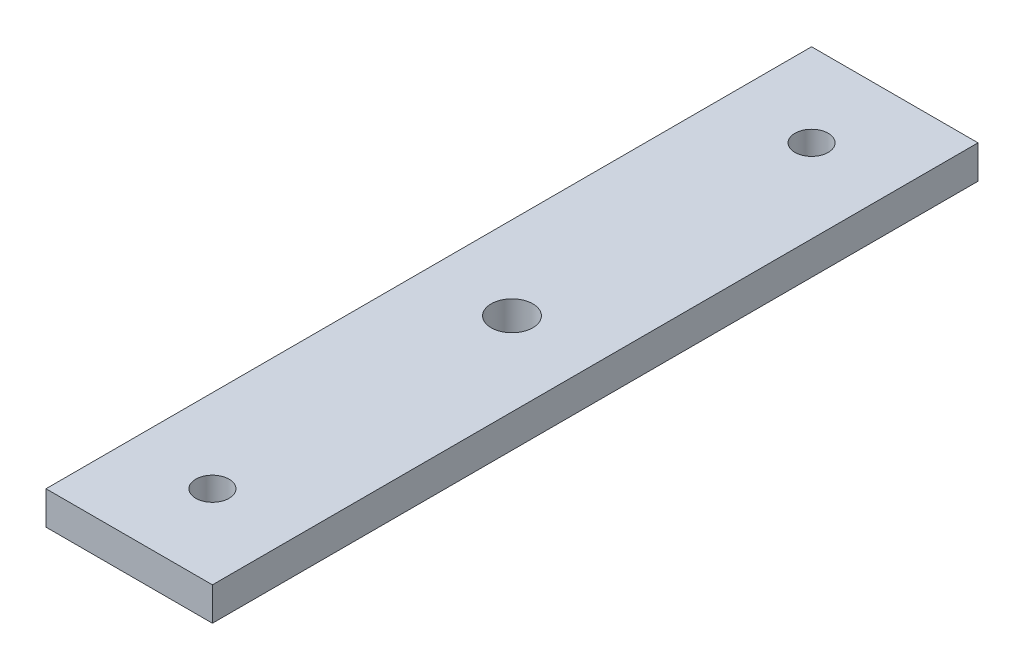
ISO-10303-21;
HEADER;
FILE_DESCRIPTION(('STEP AP214'),'2;1');
FILE_NAME('part.step','',(''),(''),'','','');
FILE_SCHEMA(('AUTOMOTIVE_DESIGN { 1 0 10303 214 1 1 1 1 }'));
ENDSEC;
DATA;
#1=APPLICATION_CONTEXT('core data for automotive mechanical design processes');
#2=APPLICATION_PROTOCOL_DEFINITION('international standard','automotive_design',2000,#1);
#3=PRODUCT_CONTEXT('',#1,'mechanical');
#4=PRODUCT('Part','Part','',(#3));
#5=PRODUCT_RELATED_PRODUCT_CATEGORY('part','',(#4));
#6=PRODUCT_DEFINITION_FORMATION('','',#4);
#7=PRODUCT_DEFINITION_CONTEXT('part definition',#1,'design');
#8=PRODUCT_DEFINITION('design','',#6,#7);
#9=PRODUCT_DEFINITION_SHAPE('','',#8);
#10=(LENGTH_UNIT() NAMED_UNIT(*) SI_UNIT(.MILLI.,.METRE.));
#11=(NAMED_UNIT(*) PLANE_ANGLE_UNIT() SI_UNIT($,.RADIAN.));
#12=(NAMED_UNIT(*) SI_UNIT($,.STERADIAN.) SOLID_ANGLE_UNIT());
#13=UNCERTAINTY_MEASURE_WITH_UNIT(LENGTH_MEASURE(1.E-05),#10,'distance_accuracy_value','');
#14=(GEOMETRIC_REPRESENTATION_CONTEXT(3) GLOBAL_UNCERTAINTY_ASSIGNED_CONTEXT((#13)) GLOBAL_UNIT_ASSIGNED_CONTEXT((#10,
#11,#12)) REPRESENTATION_CONTEXT('',''));
#15=CARTESIAN_POINT('',(0.,0.,0.));
#16=DIRECTION('',(0.,0.,1.));
#17=DIRECTION('',(1.,0.,0.));
#18=AXIS2_PLACEMENT_3D('',#15,#16,#17);
#19=CARTESIAN_POINT('',(0.,20.,0.));
#20=DIRECTION('',(0.,1.,0.));
#21=DIRECTION('',(0.,0.,1.));
#22=AXIS2_PLACEMENT_3D('',#19,#20,#21);
#23=PLANE('',#22);
#24=CARTESIAN_POINT('',(0.,20.,0.));
#25=DIRECTION('',(0.,1.,0.));
#26=DIRECTION('',(0.,0.,1.));
#27=AXIS2_PLACEMENT_3D('',#24,#25,#26);
#28=CIRCLE('',#27,12.5);
#29=CARTESIAN_POINT('',(0.,20.,12.5));
#30=VERTEX_POINT('',#29);
#31=EDGE_CURVE('E145',#30,#30,#28,.T.);
#32=ORIENTED_EDGE('',*,*,#31,.F.);
#33=EDGE_LOOP('',(#32));
#34=FACE_BOUND('',#33,.T.);
#35=CARTESIAN_POINT('',(0.,20.,180.));
#36=DIRECTION('',(0.,1.,0.));
#37=DIRECTION('',(0.,0.,1.));
#38=AXIS2_PLACEMENT_3D('',#35,#36,#37);
#39=CIRCLE('',#38,10.);
#40=CARTESIAN_POINT('',(0.,20.,190.));
#41=VERTEX_POINT('',#40);
#42=EDGE_CURVE('E111',#41,#41,#39,.T.);
#43=ORIENTED_EDGE('',*,*,#42,.F.);
#44=EDGE_LOOP('',(#43));
#45=FACE_BOUND('',#44,.T.);
#46=DIRECTION('',(0.,0.,-1.));
#47=VECTOR('',#46,1.);
#48=CARTESIAN_POINT('',(50.,20.,-230.));
#49=LINE('',#48,#47);
#50=CARTESIAN_POINT('',(50.,20.,230.));
#51=VERTEX_POINT('',#50);
#52=CARTESIAN_POINT('',(50.,20.,-230.));
#53=VERTEX_POINT('',#52);
#54=EDGE_CURVE('E91',#51,#53,#49,.T.);
#55=ORIENTED_EDGE('',*,*,#54,.T.);
#56=DIRECTION('',(-1.,0.,0.));
#57=VECTOR('',#56,1.);
#58=CARTESIAN_POINT('',(-50.,20.,-230.));
#59=LINE('',#58,#57);
#60=CARTESIAN_POINT('',(-50.,20.,-230.));
#61=VERTEX_POINT('',#60);
#62=EDGE_CURVE('E86',#53,#61,#59,.T.);
#63=ORIENTED_EDGE('',*,*,#62,.T.);
#64=DIRECTION('',(0.,0.,1.));
#65=VECTOR('',#64,1.);
#66=CARTESIAN_POINT('',(-50.,20.,-230.));
#67=LINE('',#66,#65);
#68=CARTESIAN_POINT('',(-50.,20.,230.));
#69=VERTEX_POINT('',#68);
#70=EDGE_CURVE('E89',#61,#69,#67,.T.);
#71=ORIENTED_EDGE('',*,*,#70,.T.);
#72=DIRECTION('',(1.,0.,0.));
#73=VECTOR('',#72,1.);
#74=CARTESIAN_POINT('',(-50.,20.,230.));
#75=LINE('',#74,#73);
#76=EDGE_CURVE('E56',#69,#51,#75,.T.);
#77=ORIENTED_EDGE('',*,*,#76,.T.);
#78=EDGE_LOOP('',(#55,#63,#71,#77));
#79=FACE_BOUND('',#78,.T.);
#80=CARTESIAN_POINT('',(0.,20.,-180.));
#81=DIRECTION('',(0.,1.,0.));
#82=DIRECTION('',(0.,0.,1.));
#83=AXIS2_PLACEMENT_3D('',#80,#81,#82);
#84=CIRCLE('',#83,10.);
#85=CARTESIAN_POINT('',(0.,20.,-170.));
#86=VERTEX_POINT('',#85);
#87=EDGE_CURVE('E133',#86,#86,#84,.T.);
#88=ORIENTED_EDGE('',*,*,#87,.F.);
#89=EDGE_LOOP('',(#88));
#90=FACE_BOUND('',#89,.T.);
#91=ADVANCED_FACE('F38',(#34,#45,#79,#90),#23,.T.);
#92=CARTESIAN_POINT('',(0.,0.,0.));
#93=DIRECTION('',(0.,1.,0.));
#94=DIRECTION('',(0.,0.,1.));
#95=AXIS2_PLACEMENT_3D('',#92,#93,#94);
#96=PLANE('',#95);
#97=CARTESIAN_POINT('',(0.,0.,0.));
#98=DIRECTION('',(0.,1.,0.));
#99=DIRECTION('',(0.,0.,1.));
#100=AXIS2_PLACEMENT_3D('',#97,#98,#99);
#101=CIRCLE('',#100,12.5);
#102=CARTESIAN_POINT('',(0.,0.,12.5));
#103=VERTEX_POINT('',#102);
#104=EDGE_CURVE('E141',#103,#103,#101,.T.);
#105=ORIENTED_EDGE('',*,*,#104,.T.);
#106=EDGE_LOOP('',(#105));
#107=FACE_BOUND('',#106,.T.);
#108=DIRECTION('',(0.,0.,-1.));
#109=VECTOR('',#108,1.);
#110=CARTESIAN_POINT('',(50.,0.,-230.));
#111=LINE('',#110,#109);
#112=CARTESIAN_POINT('',(50.,0.,230.));
#113=VERTEX_POINT('',#112);
#114=CARTESIAN_POINT('',(50.,0.,-230.));
#115=VERTEX_POINT('',#114);
#116=EDGE_CURVE('E107',#113,#115,#111,.T.);
#117=ORIENTED_EDGE('',*,*,#116,.F.);
#118=DIRECTION('',(1.,0.,0.));
#119=VECTOR('',#118,1.);
#120=CARTESIAN_POINT('',(-50.,0.,230.));
#121=LINE('',#120,#119);
#122=CARTESIAN_POINT('',(-50.,0.,230.));
#123=VERTEX_POINT('',#122);
#124=EDGE_CURVE('E79',#123,#113,#121,.T.);
#125=ORIENTED_EDGE('',*,*,#124,.F.);
#126=DIRECTION('',(0.,0.,1.));
#127=VECTOR('',#126,1.);
#128=CARTESIAN_POINT('',(-50.,0.,-230.));
#129=LINE('',#128,#127);
#130=CARTESIAN_POINT('',(-50.,0.,-230.));
#131=VERTEX_POINT('',#130);
#132=EDGE_CURVE('E73',#131,#123,#129,.T.);
#133=ORIENTED_EDGE('',*,*,#132,.F.);
#134=DIRECTION('',(-1.,0.,0.));
#135=VECTOR('',#134,1.);
#136=CARTESIAN_POINT('',(-50.,0.,-230.));
#137=LINE('',#136,#135);
#138=EDGE_CURVE('E96',#115,#131,#137,.T.);
#139=ORIENTED_EDGE('',*,*,#138,.F.);
#140=EDGE_LOOP('',(#117,#125,#133,#139));
#141=FACE_BOUND('',#140,.T.);
#142=CARTESIAN_POINT('',(0.,0.,180.));
#143=DIRECTION('',(0.,1.,0.));
#144=DIRECTION('',(0.,0.,1.));
#145=AXIS2_PLACEMENT_3D('',#142,#143,#144);
#146=CIRCLE('',#145,10.);
#147=CARTESIAN_POINT('',(0.,0.,190.));
#148=VERTEX_POINT('',#147);
#149=EDGE_CURVE('E129',#148,#148,#146,.T.);
#150=ORIENTED_EDGE('',*,*,#149,.T.);
#151=EDGE_LOOP('',(#150));
#152=FACE_BOUND('',#151,.T.);
#153=CARTESIAN_POINT('',(0.,0.,-180.));
#154=DIRECTION('',(0.,1.,0.));
#155=DIRECTION('',(0.,0.,1.));
#156=AXIS2_PLACEMENT_3D('',#153,#154,#155);
#157=CIRCLE('',#156,10.);
#158=CARTESIAN_POINT('',(0.,0.,-170.));
#159=VERTEX_POINT('',#158);
#160=EDGE_CURVE('E137',#159,#159,#157,.T.);
#161=ORIENTED_EDGE('',*,*,#160,.T.);
#162=EDGE_LOOP('',(#161));
#163=FACE_BOUND('',#162,.T.);
#164=ADVANCED_FACE('F124',(#107,#141,#152,#163),#96,.F.);
#165=CARTESIAN_POINT('',(50.,20.,-230.));
#166=DIRECTION('',(-1.,0.,0.));
#167=DIRECTION('',(0.,0.,1.));
#168=AXIS2_PLACEMENT_3D('',#165,#166,#167);
#169=PLANE('',#168);
#170=ORIENTED_EDGE('',*,*,#116,.T.);
#171=DIRECTION('',(0.,-1.,0.));
#172=VECTOR('',#171,1.);
#173=CARTESIAN_POINT('',(50.,20.,-230.));
#174=LINE('',#173,#172);
#175=EDGE_CURVE('E11',#53,#115,#174,.T.);
#176=ORIENTED_EDGE('',*,*,#175,.F.);
#177=ORIENTED_EDGE('',*,*,#54,.F.);
#178=DIRECTION('',(0.,-1.,0.));
#179=VECTOR('',#178,1.);
#180=CARTESIAN_POINT('',(50.,20.,230.));
#181=LINE('',#180,#179);
#182=EDGE_CURVE('E103',#51,#113,#181,.T.);
#183=ORIENTED_EDGE('',*,*,#182,.T.);
#184=EDGE_LOOP('',(#170,#176,#177,#183));
#185=FACE_BOUND('',#184,.T.);
#186=ADVANCED_FACE('F40',(#185),#169,.F.);
#187=CARTESIAN_POINT('',(-50.,20.,-230.));
#188=DIRECTION('',(0.,0.,1.));
#189=DIRECTION('',(1.,0.,0.));
#190=AXIS2_PLACEMENT_3D('',#187,#188,#189);
#191=PLANE('',#190);
#192=ORIENTED_EDGE('',*,*,#138,.T.);
#193=DIRECTION('',(0.,-1.,0.));
#194=VECTOR('',#193,1.);
#195=CARTESIAN_POINT('',(-50.,20.,-230.));
#196=LINE('',#195,#194);
#197=EDGE_CURVE('E48',#61,#131,#196,.T.);
#198=ORIENTED_EDGE('',*,*,#197,.F.);
#199=ORIENTED_EDGE('',*,*,#62,.F.);
#200=ORIENTED_EDGE('',*,*,#175,.T.);
#201=EDGE_LOOP('',(#192,#198,#199,#200));
#202=FACE_BOUND('',#201,.T.);
#203=ADVANCED_FACE('F95',(#202),#191,.F.);
#204=CARTESIAN_POINT('',(-50.,20.,-230.));
#205=DIRECTION('',(1.,0.,0.));
#206=DIRECTION('',(0.,0.,-1.));
#207=AXIS2_PLACEMENT_3D('',#204,#205,#206);
#208=PLANE('',#207);
#209=ORIENTED_EDGE('',*,*,#132,.T.);
#210=DIRECTION('',(0.,-1.,0.));
#211=VECTOR('',#210,1.);
#212=CARTESIAN_POINT('',(-50.,20.,230.));
#213=LINE('',#212,#211);
#214=EDGE_CURVE('E98',#69,#123,#213,.T.);
#215=ORIENTED_EDGE('',*,*,#214,.F.);
#216=ORIENTED_EDGE('',*,*,#70,.F.);
#217=ORIENTED_EDGE('',*,*,#197,.T.);
#218=EDGE_LOOP('',(#209,#215,#216,#217));
#219=FACE_BOUND('',#218,.T.);
#220=ADVANCED_FACE('F99',(#219),#208,.F.);
#221=CARTESIAN_POINT('',(-50.,20.,230.));
#222=DIRECTION('',(0.,0.,-1.));
#223=DIRECTION('',(-1.,0.,0.));
#224=AXIS2_PLACEMENT_3D('',#221,#222,#223);
#225=PLANE('',#224);
#226=ORIENTED_EDGE('',*,*,#124,.T.);
#227=ORIENTED_EDGE('',*,*,#182,.F.);
#228=ORIENTED_EDGE('',*,*,#76,.F.);
#229=ORIENTED_EDGE('',*,*,#214,.T.);
#230=EDGE_LOOP('',(#226,#227,#228,#229));
#231=FACE_BOUND('',#230,.T.);
#232=ADVANCED_FACE('F121',(#231),#225,.F.);
#233=CARTESIAN_POINT('',(0.,20.,180.));
#234=DIRECTION('',(0.,-1.,0.));
#235=DIRECTION('',(0.,0.,-1.));
#236=AXIS2_PLACEMENT_3D('',#233,#234,#235);
#237=CYLINDRICAL_SURFACE('',#236,10.);
#238=ORIENTED_EDGE('',*,*,#42,.T.);
#239=EDGE_LOOP('',(#238));
#240=FACE_BOUND('',#239,.T.);
#241=ORIENTED_EDGE('',*,*,#149,.F.);
#242=EDGE_LOOP('',(#241));
#243=FACE_BOUND('',#242,.T.);
#244=ADVANCED_FACE('F166',(#240,#243),#237,.F.);
#245=CARTESIAN_POINT('',(0.,20.,-180.));
#246=DIRECTION('',(0.,-1.,0.));
#247=DIRECTION('',(0.,0.,-1.));
#248=AXIS2_PLACEMENT_3D('',#245,#246,#247);
#249=CYLINDRICAL_SURFACE('',#248,10.);
#250=ORIENTED_EDGE('',*,*,#87,.T.);
#251=EDGE_LOOP('',(#250));
#252=FACE_BOUND('',#251,.T.);
#253=ORIENTED_EDGE('',*,*,#160,.F.);
#254=EDGE_LOOP('',(#253));
#255=FACE_BOUND('',#254,.T.);
#256=ADVANCED_FACE('F157',(#252,#255),#249,.F.);
#257=CARTESIAN_POINT('',(0.,0.,0.));
#258=DIRECTION('',(0.,1.,0.));
#259=DIRECTION('',(0.,0.,1.));
#260=AXIS2_PLACEMENT_3D('',#257,#258,#259);
#261=CYLINDRICAL_SURFACE('',#260,12.5);
#262=ORIENTED_EDGE('',*,*,#104,.F.);
#263=EDGE_LOOP('',(#262));
#264=FACE_BOUND('',#263,.T.);
#265=ORIENTED_EDGE('',*,*,#31,.T.);
#266=EDGE_LOOP('',(#265));
#267=FACE_BOUND('',#266,.T.);
#268=ADVANCED_FACE('F154',(#264,#267),#261,.F.);
#269=CLOSED_SHELL('',(#91,#164,#186,#203,#220,#232,#244,#256,#268));
#270=MANIFOLD_SOLID_BREP('B2',#269);
#271=ADVANCED_BREP_SHAPE_REPRESENTATION('',(#18,#270),#14);
#272=SHAPE_DEFINITION_REPRESENTATION(#9,#271);
ENDSEC;
END-ISO-10303-21;
